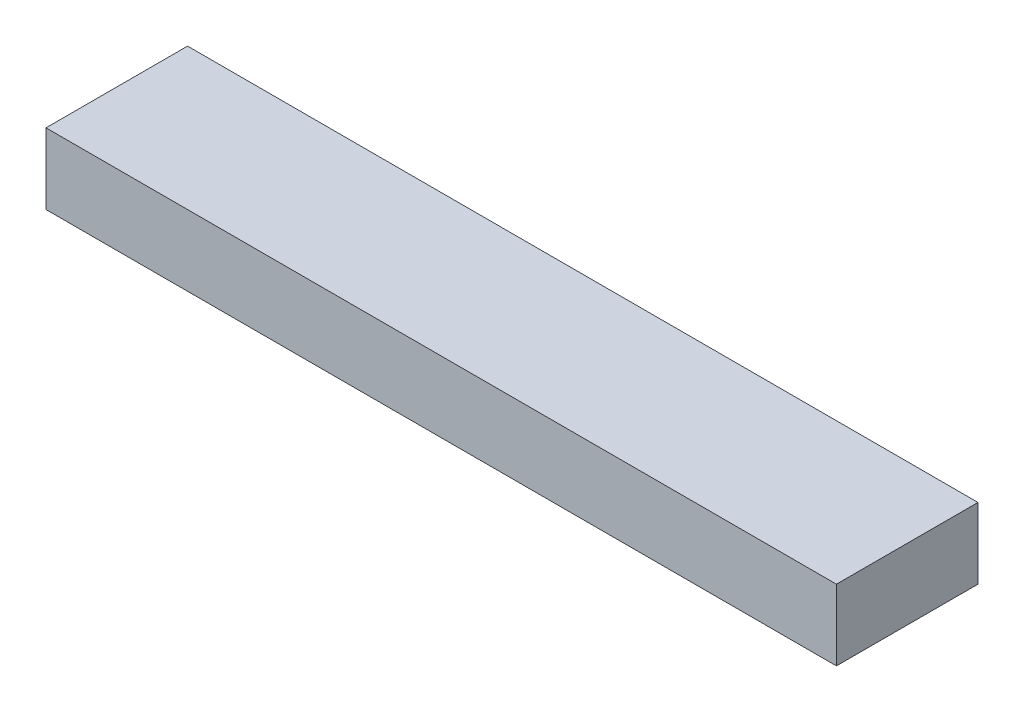
ISO-10303-21;
HEADER;
FILE_DESCRIPTION(('STEP AP214'),'2;1');
FILE_NAME('part.step','',(''),(''),'','','');
FILE_SCHEMA(('AUTOMOTIVE_DESIGN { 1 0 10303 214 1 1 1 1 }'));
ENDSEC;
DATA;
#1=APPLICATION_CONTEXT('core data for automotive mechanical design processes');
#2=APPLICATION_PROTOCOL_DEFINITION('international standard','automotive_design',2000,#1);
#3=PRODUCT_CONTEXT('',#1,'mechanical');
#4=PRODUCT('Part','Part','',(#3));
#5=PRODUCT_RELATED_PRODUCT_CATEGORY('part','',(#4));
#6=PRODUCT_DEFINITION_FORMATION('','',#4);
#7=PRODUCT_DEFINITION_CONTEXT('part definition',#1,'design');
#8=PRODUCT_DEFINITION('design','',#6,#7);
#9=PRODUCT_DEFINITION_SHAPE('','',#8);
#10=(LENGTH_UNIT() NAMED_UNIT(*) SI_UNIT(.MILLI.,.METRE.));
#11=(NAMED_UNIT(*) PLANE_ANGLE_UNIT() SI_UNIT($,.RADIAN.));
#12=(NAMED_UNIT(*) SI_UNIT($,.STERADIAN.) SOLID_ANGLE_UNIT());
#13=UNCERTAINTY_MEASURE_WITH_UNIT(LENGTH_MEASURE(1.E-05),#10,'distance_accuracy_value','');
#14=(GEOMETRIC_REPRESENTATION_CONTEXT(3) GLOBAL_UNCERTAINTY_ASSIGNED_CONTEXT((#13)) GLOBAL_UNIT_ASSIGNED_CONTEXT((#10,
#11,#12)) REPRESENTATION_CONTEXT('',''));
#15=CARTESIAN_POINT('',(0.,0.,0.));
#16=DIRECTION('',(0.,0.,1.));
#17=DIRECTION('',(1.,0.,0.));
#18=AXIS2_PLACEMENT_3D('',#15,#16,#17);
#19=CARTESIAN_POINT('',(0.,19.05,0.));
#20=DIRECTION('',(1.,0.,0.));
#21=DIRECTION('',(0.,0.,-1.));
#22=AXIS2_PLACEMENT_3D('',#19,#20,#21);
#23=PLANE('',#22);
#24=DIRECTION('',(0.,0.,1.));
#25=VECTOR('',#24,1.);
#26=CARTESIAN_POINT('',(0.,0.,0.));
#27=LINE('',#26,#25);
#28=CARTESIAN_POINT('',(0.,0.,-38.1));
#29=VERTEX_POINT('',#28);
#30=CARTESIAN_POINT('',(0.,0.,0.));
#31=VERTEX_POINT('',#30);
#32=EDGE_CURVE('E101',#29,#31,#27,.T.);
#33=ORIENTED_EDGE('',*,*,#32,.T.);
#34=DIRECTION('',(0.,-1.,0.));
#35=VECTOR('',#34,1.);
#36=CARTESIAN_POINT('',(0.,19.05,0.));
#37=LINE('',#36,#35);
#38=CARTESIAN_POINT('',(0.,19.05,0.));
#39=VERTEX_POINT('',#38);
#40=EDGE_CURVE('E11',#39,#31,#37,.T.);
#41=ORIENTED_EDGE('',*,*,#40,.F.);
#42=DIRECTION('',(0.,0.,1.));
#43=VECTOR('',#42,1.);
#44=CARTESIAN_POINT('',(0.,19.05,0.));
#45=LINE('',#44,#43);
#46=CARTESIAN_POINT('',(0.,19.05,-38.1));
#47=VERTEX_POINT('',#46);
#48=EDGE_CURVE('E89',#47,#39,#45,.T.);
#49=ORIENTED_EDGE('',*,*,#48,.F.);
#50=DIRECTION('',(0.,-1.,0.));
#51=VECTOR('',#50,1.);
#52=CARTESIAN_POINT('',(0.,19.05,-38.1));
#53=LINE('',#52,#51);
#54=EDGE_CURVE('E97',#47,#29,#53,.T.);
#55=ORIENTED_EDGE('',*,*,#54,.T.);
#56=EDGE_LOOP('',(#33,#41,#49,#55));
#57=FACE_BOUND('',#56,.T.);
#58=ADVANCED_FACE('F38',(#57),#23,.F.);
#59=CARTESIAN_POINT('',(0.,19.05,0.));
#60=DIRECTION('',(0.,0.,-1.));
#61=DIRECTION('',(-1.,0.,0.));
#62=AXIS2_PLACEMENT_3D('',#59,#60,#61);
#63=PLANE('',#62);
#64=DIRECTION('',(1.,0.,0.));
#65=VECTOR('',#64,1.);
#66=CARTESIAN_POINT('',(0.,0.,0.));
#67=LINE('',#66,#65);
#68=CARTESIAN_POINT('',(212.725,0.,0.));
#69=VERTEX_POINT('',#68);
#70=EDGE_CURVE('E93',#31,#69,#67,.T.);
#71=ORIENTED_EDGE('',*,*,#70,.T.);
#72=DIRECTION('',(0.,-1.,0.));
#73=VECTOR('',#72,1.);
#74=CARTESIAN_POINT('',(212.725,19.05,0.));
#75=LINE('',#74,#73);
#76=CARTESIAN_POINT('',(212.725,19.05,0.));
#77=VERTEX_POINT('',#76);
#78=EDGE_CURVE('E46',#77,#69,#75,.T.);
#79=ORIENTED_EDGE('',*,*,#78,.F.);
#80=DIRECTION('',(1.,0.,0.));
#81=VECTOR('',#80,1.);
#82=CARTESIAN_POINT('',(0.,19.05,0.));
#83=LINE('',#82,#81);
#84=EDGE_CURVE('E84',#39,#77,#83,.T.);
#85=ORIENTED_EDGE('',*,*,#84,.F.);
#86=ORIENTED_EDGE('',*,*,#40,.T.);
#87=EDGE_LOOP('',(#71,#79,#85,#86));
#88=FACE_BOUND('',#87,.T.);
#89=ADVANCED_FACE('F92',(#88),#63,.F.);
#90=CARTESIAN_POINT('',(212.725,19.05,0.));
#91=DIRECTION('',(-1.,0.,0.));
#92=DIRECTION('',(0.,0.,1.));
#93=AXIS2_PLACEMENT_3D('',#90,#91,#92);
#94=PLANE('',#93);
#95=DIRECTION('',(0.,0.,-1.));
#96=VECTOR('',#95,1.);
#97=CARTESIAN_POINT('',(212.725,0.,0.));
#98=LINE('',#97,#96);
#99=CARTESIAN_POINT('',(212.725,0.,-38.1));
#100=VERTEX_POINT('',#99);
#101=EDGE_CURVE('E71',#69,#100,#98,.T.);
#102=ORIENTED_EDGE('',*,*,#101,.T.);
#103=DIRECTION('',(0.,-1.,0.));
#104=VECTOR('',#103,1.);
#105=CARTESIAN_POINT('',(212.725,19.05,-38.1));
#106=LINE('',#105,#104);
#107=CARTESIAN_POINT('',(212.725,19.05,-38.1));
#108=VERTEX_POINT('',#107);
#109=EDGE_CURVE('E94',#108,#100,#106,.T.);
#110=ORIENTED_EDGE('',*,*,#109,.F.);
#111=DIRECTION('',(0.,0.,-1.));
#112=VECTOR('',#111,1.);
#113=CARTESIAN_POINT('',(212.725,19.05,0.));
#114=LINE('',#113,#112);
#115=EDGE_CURVE('E87',#77,#108,#114,.T.);
#116=ORIENTED_EDGE('',*,*,#115,.F.);
#117=ORIENTED_EDGE('',*,*,#78,.T.);
#118=EDGE_LOOP('',(#102,#110,#116,#117));
#119=FACE_BOUND('',#118,.T.);
#120=ADVANCED_FACE('F95',(#119),#94,.F.);
#121=CARTESIAN_POINT('',(0.,19.05,-38.1));
#122=DIRECTION('',(0.,0.,1.));
#123=DIRECTION('',(1.,0.,0.));
#124=AXIS2_PLACEMENT_3D('',#121,#122,#123);
#125=PLANE('',#124);
#126=DIRECTION('',(-1.,0.,0.));
#127=VECTOR('',#126,1.);
#128=CARTESIAN_POINT('',(0.,0.,-38.1));
#129=LINE('',#128,#127);
#130=EDGE_CURVE('E77',#100,#29,#129,.T.);
#131=ORIENTED_EDGE('',*,*,#130,.T.);
#132=ORIENTED_EDGE('',*,*,#54,.F.);
#133=DIRECTION('',(-1.,0.,0.));
#134=VECTOR('',#133,1.);
#135=CARTESIAN_POINT('',(0.,19.05,-38.1));
#136=LINE('',#135,#134);
#137=EDGE_CURVE('E54',#108,#47,#136,.T.);
#138=ORIENTED_EDGE('',*,*,#137,.F.);
#139=ORIENTED_EDGE('',*,*,#109,.T.);
#140=EDGE_LOOP('',(#131,#132,#138,#139));
#141=FACE_BOUND('',#140,.T.);
#142=ADVANCED_FACE('F108',(#141),#125,.F.);
#143=CARTESIAN_POINT('',(0.,19.05,0.));
#144=DIRECTION('',(0.,-1.,0.));
#145=DIRECTION('',(0.,0.,-1.));
#146=AXIS2_PLACEMENT_3D('',#143,#144,#145);
#147=PLANE('',#146);
#148=ORIENTED_EDGE('',*,*,#48,.T.);
#149=ORIENTED_EDGE('',*,*,#84,.T.);
#150=ORIENTED_EDGE('',*,*,#115,.T.);
#151=ORIENTED_EDGE('',*,*,#137,.T.);
#152=EDGE_LOOP('',(#148,#149,#150,#151));
#153=FACE_BOUND('',#152,.T.);
#154=ADVANCED_FACE('F85',(#153),#147,.F.);
#155=CARTESIAN_POINT('',(0.,0.,0.));
#156=DIRECTION('',(0.,-1.,0.));
#157=DIRECTION('',(0.,0.,-1.));
#158=AXIS2_PLACEMENT_3D('',#155,#156,#157);
#159=PLANE('',#158);
#160=ORIENTED_EDGE('',*,*,#32,.F.);
#161=ORIENTED_EDGE('',*,*,#130,.F.);
#162=ORIENTED_EDGE('',*,*,#101,.F.);
#163=ORIENTED_EDGE('',*,*,#70,.F.);
#164=EDGE_LOOP('',(#160,#161,#162,#163));
#165=FACE_BOUND('',#164,.T.);
#166=ADVANCED_FACE('F111',(#165),#159,.T.);
#167=CLOSED_SHELL('',(#58,#89,#120,#142,#154,#166));
#168=MANIFOLD_SOLID_BREP('B2',#167);
#169=ADVANCED_BREP_SHAPE_REPRESENTATION('',(#18,#168),#14);
#170=SHAPE_DEFINITION_REPRESENTATION(#9,#169);
ENDSEC;
END-ISO-10303-21;
